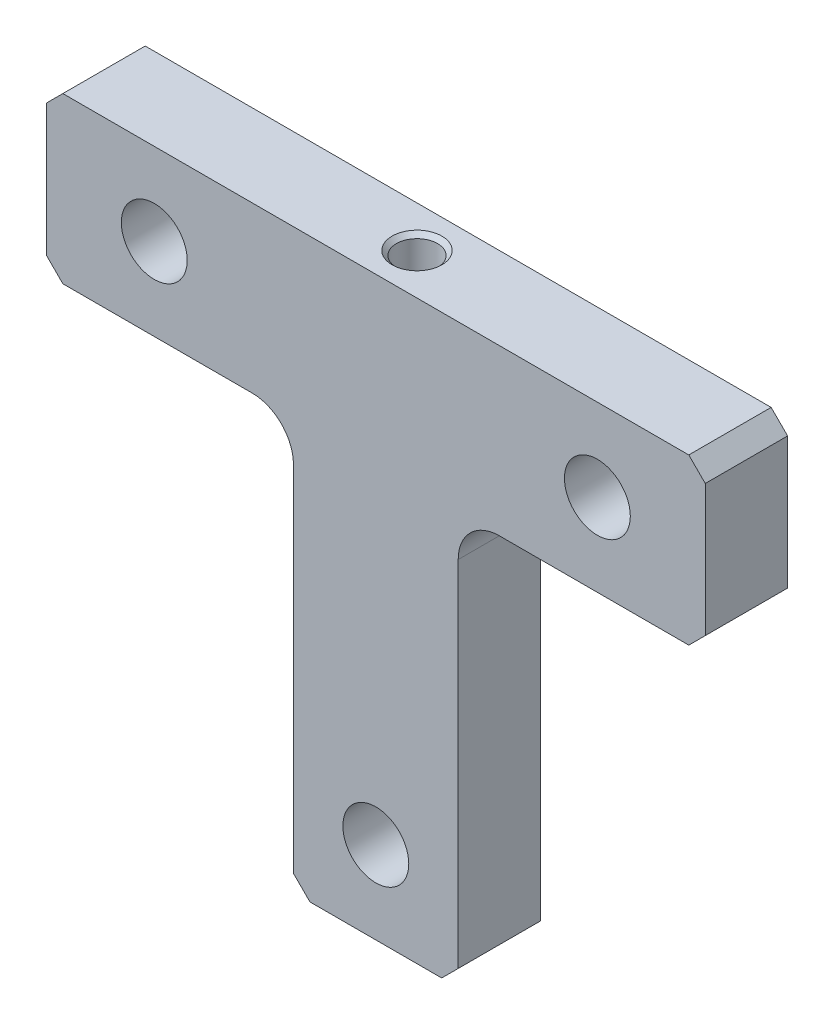
ISO-10303-21;
HEADER;
FILE_DESCRIPTION(('STEP AP214'),'2;1');
FILE_NAME('part.step','',(''),(''),'','','');
FILE_SCHEMA(('AUTOMOTIVE_DESIGN { 1 0 10303 214 1 1 1 1 }'));
ENDSEC;
DATA;
#1=APPLICATION_CONTEXT('core data for automotive mechanical design processes');
#2=APPLICATION_PROTOCOL_DEFINITION('international standard','automotive_design',2000,#1);
#3=PRODUCT_CONTEXT('',#1,'mechanical');
#4=PRODUCT('Part','Part','',(#3));
#5=PRODUCT_RELATED_PRODUCT_CATEGORY('part','',(#4));
#6=PRODUCT_DEFINITION_FORMATION('','',#4);
#7=PRODUCT_DEFINITION_CONTEXT('part definition',#1,'design');
#8=PRODUCT_DEFINITION('design','',#6,#7);
#9=PRODUCT_DEFINITION_SHAPE('','',#8);
#10=(LENGTH_UNIT() NAMED_UNIT(*) SI_UNIT(.MILLI.,.METRE.));
#11=(NAMED_UNIT(*) PLANE_ANGLE_UNIT() SI_UNIT($,.RADIAN.));
#12=(NAMED_UNIT(*) SI_UNIT($,.STERADIAN.) SOLID_ANGLE_UNIT());
#13=UNCERTAINTY_MEASURE_WITH_UNIT(LENGTH_MEASURE(1.E-05),#10,'distance_accuracy_value','');
#14=(GEOMETRIC_REPRESENTATION_CONTEXT(3) GLOBAL_UNCERTAINTY_ASSIGNED_CONTEXT((#13)) GLOBAL_UNIT_ASSIGNED_CONTEXT((#10,
#11,#12)) REPRESENTATION_CONTEXT('',''));
#15=CARTESIAN_POINT('',(0.,0.,0.));
#16=DIRECTION('',(0.,0.,1.));
#17=DIRECTION('',(1.,0.,0.));
#18=AXIS2_PLACEMENT_3D('',#15,#16,#17);
#19=CARTESIAN_POINT('',(10.0000000000001,-10.,4.99999999999994));
#20=DIRECTION('',(0.,1.00000000000001,0.));
#21=DIRECTION('',(-1.00000000000001,0.,0.));
#22=AXIS2_PLACEMENT_3D('',#19,#20,#21);
#23=PLANE('',#22);
#24=DIRECTION('',(1.00000000000001,0.,0.));
#25=VECTOR('',#24,1.);
#26=CARTESIAN_POINT('',(10.0000000000001,-10.,4.99999999999994));
#27=LINE('',#26,#25);
#28=CARTESIAN_POINT('',(-8.0000000000002,-9.99999999999998,4.99999999999994));
#29=VERTEX_POINT('',#28);
#30=CARTESIAN_POINT('',(8.0000000000001,-10.0000000000001,4.99999999999994));
#31=VERTEX_POINT('',#30);
#32=EDGE_CURVE('E204',#29,#31,#27,.T.);
#33=ORIENTED_EDGE('',*,*,#32,.F.);
#34=DIRECTION('',(0.,0.,-0.99999999999999));
#35=VECTOR('',#34,1.);
#36=CARTESIAN_POINT('',(-8.0000000000002,-9.99999999999998,4.99999999999994));
#37=LINE('',#36,#35);
#38=CARTESIAN_POINT('',(-8.0000000000002,-9.99999999999998,-4.99999999999994));
#39=VERTEX_POINT('',#38);
#40=EDGE_CURVE('E320',#29,#39,#37,.T.);
#41=ORIENTED_EDGE('',*,*,#40,.T.);
#42=DIRECTION('',(1.00000000000001,0.,0.));
#43=VECTOR('',#42,1.);
#44=CARTESIAN_POINT('',(10.0000000000001,-10.,-4.99999999999994));
#45=LINE('',#44,#43);
#46=CARTESIAN_POINT('',(8.0000000000001,-10.0000000000001,-4.99999999999994));
#47=VERTEX_POINT('',#46);
#48=EDGE_CURVE('E200',#39,#47,#45,.T.);
#49=ORIENTED_EDGE('',*,*,#48,.T.);
#50=DIRECTION('',(0.,0.,0.99999999999999));
#51=VECTOR('',#50,1.);
#52=CARTESIAN_POINT('',(8.0000000000001,-10.0000000000001,4.99999999999994));
#53=LINE('',#52,#51);
#54=EDGE_CURVE('E317',#47,#31,#53,.T.);
#55=ORIENTED_EDGE('',*,*,#54,.T.);
#56=EDGE_LOOP('',(#33,#41,#49,#55));
#57=FACE_BOUND('',#56,.T.);
#58=ADVANCED_FACE('F44',(#57),#23,.F.);
#59=CARTESIAN_POINT('',(10.0000000000001,40.0000000000005,4.99999999999994));
#60=DIRECTION('',(-1.00000000000001,0.,0.));
#61=DIRECTION('',(0.,-1.00000000000001,0.));
#62=AXIS2_PLACEMENT_3D('',#59,#60,#61);
#63=PLANE('',#62);
#64=DIRECTION('',(0.,1.00000000000001,0.));
#65=VECTOR('',#64,1.);
#66=CARTESIAN_POINT('',(10.0000000000001,40.0000000000005,-4.99999999999994));
#67=LINE('',#66,#65);
#68=CARTESIAN_POINT('',(10.,-8.00000000000006,-4.99999999999994));
#69=VERTEX_POINT('',#68);
#70=CARTESIAN_POINT('',(10.0000000000001,35.0000000000006,-4.99999999999994));
#71=VERTEX_POINT('',#70);
#72=EDGE_CURVE('E238',#69,#71,#67,.T.);
#73=ORIENTED_EDGE('',*,*,#72,.T.);
#74=DIRECTION('',(0.,0.,-0.99999999999999));
#75=VECTOR('',#74,1.);
#76=CARTESIAN_POINT('',(10.0000000000001,35.0000000000006,4.99999999999994));
#77=LINE('',#76,#75);
#78=CARTESIAN_POINT('',(10.0000000000001,35.0000000000006,4.99999999999994));
#79=VERTEX_POINT('',#78);
#80=EDGE_CURVE('E66',#71,#79,#77,.F.);
#81=ORIENTED_EDGE('',*,*,#80,.T.);
#82=DIRECTION('',(0.,1.00000000000001,0.));
#83=VECTOR('',#82,1.);
#84=CARTESIAN_POINT('',(10.0000000000001,40.0000000000005,4.99999999999994));
#85=LINE('',#84,#83);
#86=CARTESIAN_POINT('',(10.,-8.00000000000006,4.99999999999994));
#87=VERTEX_POINT('',#86);
#88=EDGE_CURVE('E208',#87,#79,#85,.T.);
#89=ORIENTED_EDGE('',*,*,#88,.F.);
#90=DIRECTION('',(0.,0.,-0.99999999999999));
#91=VECTOR('',#90,1.);
#92=CARTESIAN_POINT('',(10.,-8.00000000000006,4.99999999999994));
#93=LINE('',#92,#91);
#94=EDGE_CURVE('E328',#87,#69,#93,.T.);
#95=ORIENTED_EDGE('',*,*,#94,.T.);
#96=EDGE_LOOP('',(#73,#81,#89,#95));
#97=FACE_BOUND('',#96,.T.);
#98=ADVANCED_FACE('F474',(#97),#63,.F.);
#99=CARTESIAN_POINT('',(40.0000000000005,40.0000000000007,4.99999999999994));
#100=DIRECTION('',(0.,1.00000000000001,0.));
#101=DIRECTION('',(-1.00000000000001,0.,0.));
#102=AXIS2_PLACEMENT_3D('',#99,#100,#101);
#103=PLANE('',#102);
#104=DIRECTION('',(1.00000000000001,0.,0.));
#105=VECTOR('',#104,1.);
#106=CARTESIAN_POINT('',(40.0000000000005,40.0000000000007,4.99999999999994));
#107=LINE('',#106,#105);
#108=CARTESIAN_POINT('',(15.0000000000002,40.0000000000008,4.99999999999994));
#109=VERTEX_POINT('',#108);
#110=CARTESIAN_POINT('',(38.0000000000006,40.0000000000007,4.99999999999994));
#111=VERTEX_POINT('',#110);
#112=EDGE_CURVE('E212',#109,#111,#107,.T.);
#113=ORIENTED_EDGE('',*,*,#112,.F.);
#114=DIRECTION('',(0.,0.,-0.99999999999999));
#115=VECTOR('',#114,1.);
#116=CARTESIAN_POINT('',(15.0000000000002,40.0000000000008,-4.99999999999994));
#117=LINE('',#116,#115);
#118=CARTESIAN_POINT('',(15.0000000000002,40.0000000000008,-4.99999999999994));
#119=VERTEX_POINT('',#118);
#120=EDGE_CURVE('E350',#109,#119,#117,.T.);
#121=ORIENTED_EDGE('',*,*,#120,.T.);
#122=DIRECTION('',(1.00000000000001,0.,0.));
#123=VECTOR('',#122,1.);
#124=CARTESIAN_POINT('',(40.0000000000005,40.0000000000007,-4.99999999999994));
#125=LINE('',#124,#123);
#126=CARTESIAN_POINT('',(38.0000000000006,40.0000000000007,-4.99999999999994));
#127=VERTEX_POINT('',#126);
#128=EDGE_CURVE('E241',#119,#127,#125,.T.);
#129=ORIENTED_EDGE('',*,*,#128,.T.);
#130=DIRECTION('',(0.,0.,0.99999999999999));
#131=VECTOR('',#130,1.);
#132=CARTESIAN_POINT('',(38.0000000000006,40.0000000000007,4.99999999999994));
#133=LINE('',#132,#131);
#134=EDGE_CURVE('E339',#127,#111,#133,.T.);
#135=ORIENTED_EDGE('',*,*,#134,.T.);
#136=EDGE_LOOP('',(#113,#121,#129,#135));
#137=FACE_BOUND('',#136,.T.);
#138=ADVANCED_FACE('F468',(#137),#103,.F.);
#139=CARTESIAN_POINT('',(40.0000000000006,60.0000000000011,4.99999999999994));
#140=DIRECTION('',(-1.00000000000001,0.,0.));
#141=DIRECTION('',(0.,-1.00000000000001,0.));
#142=AXIS2_PLACEMENT_3D('',#139,#140,#141);
#143=PLANE('',#142);
#144=DIRECTION('',(0.,1.00000000000001,0.));
#145=VECTOR('',#144,1.);
#146=CARTESIAN_POINT('',(40.0000000000006,60.0000000000011,4.99999999999994));
#147=LINE('',#146,#145);
#148=CARTESIAN_POINT('',(40.0000000000006,42.0000000000005,4.99999999999994));
#149=VERTEX_POINT('',#148);
#150=CARTESIAN_POINT('',(40.0000000000006,58.0000000000009,4.99999999999994));
#151=VERTEX_POINT('',#150);
#152=EDGE_CURVE('E215',#149,#151,#147,.T.);
#153=ORIENTED_EDGE('',*,*,#152,.F.);
#154=DIRECTION('',(0.,0.,-0.99999999999999));
#155=VECTOR('',#154,1.);
#156=CARTESIAN_POINT('',(40.0000000000006,42.0000000000005,4.99999999999994));
#157=LINE('',#156,#155);
#158=CARTESIAN_POINT('',(40.0000000000006,42.0000000000005,-4.99999999999994));
#159=VERTEX_POINT('',#158);
#160=EDGE_CURVE('E335',#149,#159,#157,.T.);
#161=ORIENTED_EDGE('',*,*,#160,.T.);
#162=DIRECTION('',(0.,1.00000000000001,0.));
#163=VECTOR('',#162,1.);
#164=CARTESIAN_POINT('',(40.0000000000006,60.0000000000011,-4.99999999999994));
#165=LINE('',#164,#163);
#166=CARTESIAN_POINT('',(40.0000000000006,58.0000000000009,-4.99999999999994));
#167=VERTEX_POINT('',#166);
#168=EDGE_CURVE('E244',#159,#167,#165,.T.);
#169=ORIENTED_EDGE('',*,*,#168,.T.);
#170=DIRECTION('',(0.,0.,0.99999999999999));
#171=VECTOR('',#170,1.);
#172=CARTESIAN_POINT('',(40.0000000000006,58.0000000000009,4.99999999999994));
#173=LINE('',#172,#171);
#174=EDGE_CURVE('E332',#167,#151,#173,.T.);
#175=ORIENTED_EDGE('',*,*,#174,.T.);
#176=EDGE_LOOP('',(#153,#161,#169,#175));
#177=FACE_BOUND('',#176,.T.);
#178=ADVANCED_FACE('F460',(#177),#143,.F.);
#179=CARTESIAN_POINT('',(-40.0000000000005,60.0000000000009,4.99999999999994));
#180=DIRECTION('',(0.,-1.00000000000001,0.));
#181=DIRECTION('',(0.,0.,-0.99999999999999));
#182=AXIS2_PLACEMENT_3D('',#179,#180,#181);
#183=PLANE('',#182);
#184=CARTESIAN_POINT('',(0.,60.0000000000009,0.));
#185=DIRECTION('',(0.,1.00000000000001,0.));
#186=DIRECTION('',(0.,0.,0.99999999999999));
#187=AXIS2_PLACEMENT_3D('',#184,#185,#186);
#188=CIRCLE('',#187,3.025);
#189=CARTESIAN_POINT('',(0.,60.0000000000009,3.02499999999997));
#190=VERTEX_POINT('',#189);
#191=EDGE_CURVE('E180',#190,#190,#188,.T.);
#192=ORIENTED_EDGE('',*,*,#191,.F.);
#193=EDGE_LOOP('',(#192));
#194=FACE_BOUND('',#193,.T.);
#195=DIRECTION('',(-1.00000000000001,0.,0.));
#196=VECTOR('',#195,1.);
#197=CARTESIAN_POINT('',(-40.0000000000005,60.0000000000009,-4.99999999999994));
#198=LINE('',#197,#196);
#199=CARTESIAN_POINT('',(38.0000000000006,60.0000000000009,-4.99999999999994));
#200=VERTEX_POINT('',#199);
#201=CARTESIAN_POINT('',(-38.0000000000006,60.0000000000009,-4.99999999999994));
#202=VERTEX_POINT('',#201);
#203=EDGE_CURVE('E248',#200,#202,#198,.T.);
#204=ORIENTED_EDGE('',*,*,#203,.T.);
#205=DIRECTION('',(0.,0.,0.99999999999999));
#206=VECTOR('',#205,1.);
#207=CARTESIAN_POINT('',(-38.0000000000006,60.0000000000009,4.99999999999994));
#208=LINE('',#207,#206);
#209=CARTESIAN_POINT('',(-38.0000000000006,60.0000000000009,4.99999999999994));
#210=VERTEX_POINT('',#209);
#211=EDGE_CURVE('E292',#202,#210,#208,.T.);
#212=ORIENTED_EDGE('',*,*,#211,.T.);
#213=DIRECTION('',(-1.00000000000001,0.,0.));
#214=VECTOR('',#213,1.);
#215=CARTESIAN_POINT('',(-40.0000000000005,60.0000000000009,4.99999999999994));
#216=LINE('',#215,#214);
#217=CARTESIAN_POINT('',(38.0000000000006,60.0000000000009,4.99999999999994));
#218=VERTEX_POINT('',#217);
#219=EDGE_CURVE('E219',#218,#210,#216,.T.);
#220=ORIENTED_EDGE('',*,*,#219,.F.);
#221=DIRECTION('',(0.,0.,-0.99999999999999));
#222=VECTOR('',#221,1.);
#223=CARTESIAN_POINT('',(38.0000000000006,60.0000000000009,4.99999999999994));
#224=LINE('',#223,#222);
#225=EDGE_CURVE('E288',#218,#200,#224,.T.);
#226=ORIENTED_EDGE('',*,*,#225,.T.);
#227=EDGE_LOOP('',(#204,#212,#220,#226));
#228=FACE_BOUND('',#227,.T.);
#229=ADVANCED_FACE('F450',(#194,#228),#183,.F.);
#230=CARTESIAN_POINT('',(-40.0000000000006,40.0000000000005,4.99999999999994));
#231=DIRECTION('',(1.00000000000001,0.,0.));
#232=DIRECTION('',(0.,0.,-0.99999999999999));
#233=AXIS2_PLACEMENT_3D('',#230,#231,#232);
#234=PLANE('',#233);
#235=DIRECTION('',(0.,-1.00000000000001,0.));
#236=VECTOR('',#235,1.);
#237=CARTESIAN_POINT('',(-40.0000000000006,40.0000000000005,4.99999999999994));
#238=LINE('',#237,#236);
#239=CARTESIAN_POINT('',(-40.0000000000005,58.0000000000009,4.99999999999994));
#240=VERTEX_POINT('',#239);
#241=CARTESIAN_POINT('',(-40.0000000000006,42.0000000000005,4.99999999999994));
#242=VERTEX_POINT('',#241);
#243=EDGE_CURVE('E223',#240,#242,#238,.T.);
#244=ORIENTED_EDGE('',*,*,#243,.F.);
#245=DIRECTION('',(0.,0.,-0.99999999999999));
#246=VECTOR('',#245,1.);
#247=CARTESIAN_POINT('',(-40.0000000000005,58.0000000000009,4.99999999999994));
#248=LINE('',#247,#246);
#249=CARTESIAN_POINT('',(-40.0000000000005,58.0000000000009,-4.99999999999994));
#250=VERTEX_POINT('',#249);
#251=EDGE_CURVE('E264',#240,#250,#248,.T.);
#252=ORIENTED_EDGE('',*,*,#251,.T.);
#253=DIRECTION('',(0.,-1.00000000000001,0.));
#254=VECTOR('',#253,1.);
#255=CARTESIAN_POINT('',(-40.0000000000006,40.0000000000005,-4.99999999999994));
#256=LINE('',#255,#254);
#257=CARTESIAN_POINT('',(-40.0000000000006,42.0000000000005,-4.99999999999994));
#258=VERTEX_POINT('',#257);
#259=EDGE_CURVE('E252',#250,#258,#256,.T.);
#260=ORIENTED_EDGE('',*,*,#259,.T.);
#261=DIRECTION('',(0.,0.,0.99999999999999));
#262=VECTOR('',#261,1.);
#263=CARTESIAN_POINT('',(-40.0000000000006,42.0000000000005,4.99999999999994));
#264=LINE('',#263,#262);
#265=EDGE_CURVE('E234',#258,#242,#264,.T.);
#266=ORIENTED_EDGE('',*,*,#265,.T.);
#267=EDGE_LOOP('',(#244,#252,#260,#266));
#268=FACE_BOUND('',#267,.T.);
#269=ADVANCED_FACE('F442',(#268),#234,.F.);
#270=CARTESIAN_POINT('',(-10.0000000000002,40.0000000000007,4.99999999999994));
#271=DIRECTION('',(0.,1.00000000000001,0.));
#272=DIRECTION('',(-1.00000000000001,0.,0.));
#273=AXIS2_PLACEMENT_3D('',#270,#271,#272);
#274=PLANE('',#273);
#275=DIRECTION('',(1.00000000000001,0.,0.));
#276=VECTOR('',#275,1.);
#277=CARTESIAN_POINT('',(-10.0000000000002,40.0000000000007,-4.99999999999994));
#278=LINE('',#277,#276);
#279=CARTESIAN_POINT('',(-38.0000000000006,40.0000000000007,-4.99999999999994));
#280=VERTEX_POINT('',#279);
#281=CARTESIAN_POINT('',(-15.0000000000002,40.0000000000005,-4.99999999999994));
#282=VERTEX_POINT('',#281);
#283=EDGE_CURVE('E256',#280,#282,#278,.T.);
#284=ORIENTED_EDGE('',*,*,#283,.T.);
#285=DIRECTION('',(0.,0.,-0.99999999999999));
#286=VECTOR('',#285,1.);
#287=CARTESIAN_POINT('',(-15.0000000000002,40.0000000000005,4.99999999999994));
#288=LINE('',#287,#286);
#289=CARTESIAN_POINT('',(-15.0000000000002,40.0000000000005,4.99999999999994));
#290=VERTEX_POINT('',#289);
#291=EDGE_CURVE('E347',#282,#290,#288,.F.);
#292=ORIENTED_EDGE('',*,*,#291,.T.);
#293=DIRECTION('',(1.00000000000001,0.,0.));
#294=VECTOR('',#293,1.);
#295=CARTESIAN_POINT('',(-10.0000000000002,40.0000000000007,4.99999999999994));
#296=LINE('',#295,#294);
#297=CARTESIAN_POINT('',(-38.0000000000006,40.0000000000007,4.99999999999994));
#298=VERTEX_POINT('',#297);
#299=EDGE_CURVE('E227',#298,#290,#296,.T.);
#300=ORIENTED_EDGE('',*,*,#299,.F.);
#301=DIRECTION('',(0.,0.,-0.99999999999999));
#302=VECTOR('',#301,1.);
#303=CARTESIAN_POINT('',(-38.0000000000006,40.0000000000007,4.99999999999994));
#304=LINE('',#303,#302);
#305=EDGE_CURVE('E313',#298,#280,#304,.T.);
#306=ORIENTED_EDGE('',*,*,#305,.T.);
#307=EDGE_LOOP('',(#284,#292,#300,#306));
#308=FACE_BOUND('',#307,.T.);
#309=ADVANCED_FACE('F434',(#308),#274,.F.);
#310=CARTESIAN_POINT('',(-10.0000000000002,-10.0000000000001,4.99999999999994));
#311=DIRECTION('',(1.00000000000001,0.,0.));
#312=DIRECTION('',(0.,0.,-0.99999999999999));
#313=AXIS2_PLACEMENT_3D('',#310,#311,#312);
#314=PLANE('',#313);
#315=DIRECTION('',(0.,-1.00000000000001,0.));
#316=VECTOR('',#315,1.);
#317=CARTESIAN_POINT('',(-10.0000000000002,-10.0000000000001,4.99999999999994));
#318=LINE('',#317,#316);
#319=CARTESIAN_POINT('',(-10.0000000000001,35.0000000000007,4.99999999999994));
#320=VERTEX_POINT('',#319);
#321=CARTESIAN_POINT('',(-10.0000000000002,-8.00000000000015,4.99999999999994));
#322=VERTEX_POINT('',#321);
#323=EDGE_CURVE('E231',#320,#322,#318,.T.);
#324=ORIENTED_EDGE('',*,*,#323,.F.);
#325=DIRECTION('',(0.,0.,-0.99999999999999));
#326=VECTOR('',#325,1.);
#327=CARTESIAN_POINT('',(-10.0000000000001,35.0000000000007,-4.99999999999994));
#328=LINE('',#327,#326);
#329=CARTESIAN_POINT('',(-10.0000000000001,35.0000000000007,-4.99999999999994));
#330=VERTEX_POINT('',#329);
#331=EDGE_CURVE('E343',#320,#330,#328,.T.);
#332=ORIENTED_EDGE('',*,*,#331,.T.);
#333=DIRECTION('',(0.,-1.00000000000001,0.));
#334=VECTOR('',#333,1.);
#335=CARTESIAN_POINT('',(-10.0000000000002,-10.0000000000001,-4.99999999999994));
#336=LINE('',#335,#334);
#337=CARTESIAN_POINT('',(-10.0000000000002,-8.00000000000015,-4.99999999999994));
#338=VERTEX_POINT('',#337);
#339=EDGE_CURVE('E209',#330,#338,#336,.T.);
#340=ORIENTED_EDGE('',*,*,#339,.T.);
#341=DIRECTION('',(0.,0.,0.99999999999999));
#342=VECTOR('',#341,1.);
#343=CARTESIAN_POINT('',(-10.0000000000002,-8.00000000000015,4.99999999999994));
#344=LINE('',#343,#342);
#345=EDGE_CURVE('E324',#338,#322,#344,.T.);
#346=ORIENTED_EDGE('',*,*,#345,.T.);
#347=EDGE_LOOP('',(#324,#332,#340,#346));
#348=FACE_BOUND('',#347,.T.);
#349=ADVANCED_FACE('F425',(#348),#314,.F.);
#350=CARTESIAN_POINT('',(0.,0.,4.99999999999994));
#351=DIRECTION('',(0.,0.,-0.99999999999999));
#352=DIRECTION('',(-1.00000000000001,0.,0.));
#353=AXIS2_PLACEMENT_3D('',#350,#351,#352);
#354=PLANE('',#353);
#355=CARTESIAN_POINT('',(-26.9000000000004,50.000000000001,4.99999999999994));
#356=DIRECTION('',(0.,0.,-0.99999999999999));
#357=DIRECTION('',(-1.00000000000001,0.,0.));
#358=AXIS2_PLACEMENT_3D('',#355,#356,#357);
#359=CIRCLE('',#358,4.);
#360=CARTESIAN_POINT('',(-30.9000000000005,50.000000000001,4.99999999999994));
#361=VERTEX_POINT('',#360);
#362=EDGE_CURVE('E170',#361,#361,#359,.T.);
#363=ORIENTED_EDGE('',*,*,#362,.T.);
#364=EDGE_LOOP('',(#363));
#365=FACE_BOUND('',#364,.T.);
#366=CARTESIAN_POINT('',(26.9000000000004,50.0000000000009,4.99999999999994));
#367=DIRECTION('',(0.,0.,0.99999999999999));
#368=DIRECTION('',(1.00000000000001,0.,0.));
#369=AXIS2_PLACEMENT_3D('',#366,#367,#368);
#370=CIRCLE('',#369,4.);
#371=CARTESIAN_POINT('',(30.9000000000004,50.0000000000009,4.99999999999994));
#372=VERTEX_POINT('',#371);
#373=EDGE_CURVE('E186',#372,#372,#370,.T.);
#374=ORIENTED_EDGE('',*,*,#373,.F.);
#375=EDGE_LOOP('',(#374));
#376=FACE_BOUND('',#375,.T.);
#377=CARTESIAN_POINT('',(0.,0.,4.99999999999994));
#378=DIRECTION('',(0.,0.,0.99999999999999));
#379=DIRECTION('',(1.00000000000001,0.,0.));
#380=AXIS2_PLACEMENT_3D('',#377,#378,#379);
#381=CIRCLE('',#380,4.);
#382=CARTESIAN_POINT('',(4.00000000000006,0.,4.99999999999994));
#383=VERTEX_POINT('',#382);
#384=EDGE_CURVE('E192',#383,#383,#381,.T.);
#385=ORIENTED_EDGE('',*,*,#384,.F.);
#386=EDGE_LOOP('',(#385));
#387=FACE_BOUND('',#386,.T.);
#388=ORIENTED_EDGE('',*,*,#219,.T.);
#389=DIRECTION('',(0.707106781186558,0.707106781186557,0.));
#390=VECTOR('',#389,1.);
#391=CARTESIAN_POINT('',(-40.0000000000005,58.0000000000009,4.99999999999994));
#392=LINE('',#391,#390);
#393=EDGE_CURVE('E310',#210,#240,#392,.F.);
#394=ORIENTED_EDGE('',*,*,#393,.T.);
#395=ORIENTED_EDGE('',*,*,#243,.T.);
#396=DIRECTION('',(-0.707106781186557,0.707106781186558,0.));
#397=VECTOR('',#396,1.);
#398=CARTESIAN_POINT('',(-38.0000000000006,40.0000000000007,4.99999999999994));
#399=LINE('',#398,#397);
#400=EDGE_CURVE('E307',#242,#298,#399,.F.);
#401=ORIENTED_EDGE('',*,*,#400,.T.);
#402=ORIENTED_EDGE('',*,*,#299,.T.);
#403=CARTESIAN_POINT('',(-15.0000000000003,35.0000000000006,4.99999999999994));
#404=DIRECTION('',(0.,0.,-0.99999999999999));
#405=DIRECTION('',(-1.00000000000001,0.,0.));
#406=AXIS2_PLACEMENT_3D('',#403,#404,#405);
#407=CIRCLE('',#406,5.);
#408=EDGE_CURVE('E359',#290,#320,#407,.T.);
#409=ORIENTED_EDGE('',*,*,#408,.T.);
#410=ORIENTED_EDGE('',*,*,#323,.T.);
#411=DIRECTION('',(-0.707106781186557,0.707106781186558,0.));
#412=VECTOR('',#411,1.);
#413=CARTESIAN_POINT('',(-8.0000000000002,-9.99999999999998,4.99999999999994));
#414=LINE('',#413,#412);
#415=EDGE_CURVE('E304',#322,#29,#414,.F.);
#416=ORIENTED_EDGE('',*,*,#415,.T.);
#417=ORIENTED_EDGE('',*,*,#32,.T.);
#418=DIRECTION('',(-0.707106781186558,-0.707106781186556,0.));
#419=VECTOR('',#418,1.);
#420=CARTESIAN_POINT('',(10.,-8.00000000000006,4.99999999999994));
#421=LINE('',#420,#419);
#422=EDGE_CURVE('E301',#31,#87,#421,.F.);
#423=ORIENTED_EDGE('',*,*,#422,.T.);
#424=ORIENTED_EDGE('',*,*,#88,.T.);
#425=CARTESIAN_POINT('',(15.0000000000002,35.0000000000007,4.99999999999994));
#426=DIRECTION('',(0.,0.,-0.99999999999999));
#427=DIRECTION('',(-1.00000000000001,0.,0.));
#428=AXIS2_PLACEMENT_3D('',#425,#426,#427);
#429=CIRCLE('',#428,5.);
#430=EDGE_CURVE('E11',#79,#109,#429,.T.);
#431=ORIENTED_EDGE('',*,*,#430,.T.);
#432=ORIENTED_EDGE('',*,*,#112,.T.);
#433=DIRECTION('',(-0.707106781186558,-0.707106781186557,0.));
#434=VECTOR('',#433,1.);
#435=CARTESIAN_POINT('',(40.0000000000006,42.0000000000005,4.99999999999994));
#436=LINE('',#435,#434);
#437=EDGE_CURVE('E298',#111,#149,#436,.F.);
#438=ORIENTED_EDGE('',*,*,#437,.T.);
#439=ORIENTED_EDGE('',*,*,#152,.T.);
#440=DIRECTION('',(0.707106781186557,-0.707106781186558,0.));
#441=VECTOR('',#440,1.);
#442=CARTESIAN_POINT('',(38.0000000000006,60.0000000000009,4.99999999999994));
#443=LINE('',#442,#441);
#444=EDGE_CURVE('E295',#151,#218,#443,.F.);
#445=ORIENTED_EDGE('',*,*,#444,.T.);
#446=EDGE_LOOP('',(#388,#394,#395,#401,#402,#409,#410,#416,#417,#423,#424,#431,#432,#438,#439,#445));
#447=FACE_BOUND('',#446,.T.);
#448=ADVANCED_FACE('F419',(#365,#376,#387,#447),#354,.F.);
#449=CARTESIAN_POINT('',(0.,0.,-4.99999999999994));
#450=DIRECTION('',(0.,0.,-0.99999999999999));
#451=DIRECTION('',(-1.00000000000001,0.,0.));
#452=AXIS2_PLACEMENT_3D('',#449,#450,#451);
#453=PLANE('',#452);
#454=CARTESIAN_POINT('',(-26.9000000000004,50.000000000001,-4.99999999999994));
#455=DIRECTION('',(0.,0.,-0.99999999999999));
#456=DIRECTION('',(-1.00000000000001,0.,0.));
#457=AXIS2_PLACEMENT_3D('',#454,#455,#456);
#458=CIRCLE('',#457,4.);
#459=CARTESIAN_POINT('',(-30.9000000000005,50.000000000001,-4.99999999999994));
#460=VERTEX_POINT('',#459);
#461=EDGE_CURVE('E177',#460,#460,#458,.T.);
#462=ORIENTED_EDGE('',*,*,#461,.F.);
#463=EDGE_LOOP('',(#462));
#464=FACE_BOUND('',#463,.T.);
#465=CARTESIAN_POINT('',(26.9000000000004,50.0000000000009,-4.99999999999994));
#466=DIRECTION('',(0.,0.,0.99999999999999));
#467=DIRECTION('',(1.00000000000001,0.,0.));
#468=AXIS2_PLACEMENT_3D('',#465,#466,#467);
#469=CIRCLE('',#468,4.);
#470=CARTESIAN_POINT('',(30.9000000000004,50.0000000000009,-4.99999999999994));
#471=VERTEX_POINT('',#470);
#472=EDGE_CURVE('E188',#471,#471,#469,.T.);
#473=ORIENTED_EDGE('',*,*,#472,.T.);
#474=EDGE_LOOP('',(#473));
#475=FACE_BOUND('',#474,.T.);
#476=CARTESIAN_POINT('',(0.,0.,-4.99999999999994));
#477=DIRECTION('',(0.,0.,0.99999999999999));
#478=DIRECTION('',(1.00000000000001,0.,0.));
#479=AXIS2_PLACEMENT_3D('',#476,#477,#478);
#480=CIRCLE('',#479,4.);
#481=CARTESIAN_POINT('',(4.00000000000006,0.,-4.99999999999994));
#482=VERTEX_POINT('',#481);
#483=EDGE_CURVE('E196',#482,#482,#480,.T.);
#484=ORIENTED_EDGE('',*,*,#483,.T.);
#485=EDGE_LOOP('',(#484));
#486=FACE_BOUND('',#485,.T.);
#487=ORIENTED_EDGE('',*,*,#259,.F.);
#488=DIRECTION('',(-0.707106781186558,-0.707106781186557,0.));
#489=VECTOR('',#488,1.);
#490=CARTESIAN_POINT('',(-49.0000000000007,49.0000000000008,-4.99999999999994));
#491=LINE('',#490,#489);
#492=EDGE_CURVE('E285',#250,#202,#491,.F.);
#493=ORIENTED_EDGE('',*,*,#492,.T.);
#494=ORIENTED_EDGE('',*,*,#203,.F.);
#495=DIRECTION('',(-0.707106781186557,0.707106781186558,0.));
#496=VECTOR('',#495,1.);
#497=CARTESIAN_POINT('',(49.0000000000007,49.0000000000007,-4.99999999999994));
#498=LINE('',#497,#496);
#499=EDGE_CURVE('E268',#200,#167,#498,.F.);
#500=ORIENTED_EDGE('',*,*,#499,.T.);
#501=ORIENTED_EDGE('',*,*,#168,.F.);
#502=DIRECTION('',(0.707106781186558,0.707106781186557,0.));
#503=VECTOR('',#502,1.);
#504=CARTESIAN_POINT('',(-1.00000000000006,1.00000000000008,-4.99999999999994));
#505=LINE('',#504,#503);
#506=EDGE_CURVE('E271',#159,#127,#505,.F.);
#507=ORIENTED_EDGE('',*,*,#506,.T.);
#508=ORIENTED_EDGE('',*,*,#128,.F.);
#509=CARTESIAN_POINT('',(15.0000000000002,35.0000000000007,-4.99999999999994));
#510=DIRECTION('',(0.,0.,-0.99999999999999));
#511=DIRECTION('',(-1.00000000000001,0.,0.));
#512=AXIS2_PLACEMENT_3D('',#509,#510,#511);
#513=CIRCLE('',#512,5.);
#514=EDGE_CURVE('E53',#119,#71,#513,.F.);
#515=ORIENTED_EDGE('',*,*,#514,.T.);
#516=ORIENTED_EDGE('',*,*,#72,.F.);
#517=DIRECTION('',(0.707106781186558,0.707106781186556,0.));
#518=VECTOR('',#517,1.);
#519=CARTESIAN_POINT('',(9.00000000000001,-8.99999999999998,-4.99999999999994));
#520=LINE('',#519,#518);
#521=EDGE_CURVE('E275',#69,#47,#520,.F.);
#522=ORIENTED_EDGE('',*,*,#521,.T.);
#523=ORIENTED_EDGE('',*,*,#48,.F.);
#524=DIRECTION('',(0.707106781186557,-0.707106781186558,0.));
#525=VECTOR('',#524,1.);
#526=CARTESIAN_POINT('',(-9.00000000000019,-9.00000000000003,-4.99999999999994));
#527=LINE('',#526,#525);
#528=EDGE_CURVE('E278',#39,#338,#527,.F.);
#529=ORIENTED_EDGE('',*,*,#528,.T.);
#530=ORIENTED_EDGE('',*,*,#339,.F.);
#531=CARTESIAN_POINT('',(-15.0000000000003,35.0000000000006,-4.99999999999994));
#532=DIRECTION('',(0.,0.,-0.99999999999999));
#533=DIRECTION('',(-1.00000000000001,0.,0.));
#534=AXIS2_PLACEMENT_3D('',#531,#532,#533);
#535=CIRCLE('',#534,5.);
#536=EDGE_CURVE('E356',#330,#282,#535,.F.);
#537=ORIENTED_EDGE('',*,*,#536,.T.);
#538=ORIENTED_EDGE('',*,*,#283,.F.);
#539=DIRECTION('',(0.707106781186557,-0.707106781186558,0.));
#540=VECTOR('',#539,1.);
#541=CARTESIAN_POINT('',(1.00000000000001,1.00000000000015,-4.99999999999994));
#542=LINE('',#541,#540);
#543=EDGE_CURVE('E282',#280,#258,#542,.F.);
#544=ORIENTED_EDGE('',*,*,#543,.T.);
#545=EDGE_LOOP('',(#487,#493,#494,#500,#501,#507,#508,#515,#516,#522,#523,#529,#530,#537,#538,#544));
#546=FACE_BOUND('',#545,.T.);
#547=ADVANCED_FACE('F432',(#464,#475,#486,#546),#453,.T.);
#548=CARTESIAN_POINT('',(0.,0.,-4.99999999999994));
#549=DIRECTION('',(0.,0.,0.99999999999999));
#550=DIRECTION('',(1.00000000000001,0.,0.));
#551=AXIS2_PLACEMENT_3D('',#548,#549,#550);
#552=CYLINDRICAL_SURFACE('',#551,4.);
#553=ORIENTED_EDGE('',*,*,#483,.F.);
#554=EDGE_LOOP('',(#553));
#555=FACE_BOUND('',#554,.T.);
#556=ORIENTED_EDGE('',*,*,#384,.T.);
#557=EDGE_LOOP('',(#556));
#558=FACE_BOUND('',#557,.T.);
#559=ADVANCED_FACE('F613',(#555,#558),#552,.F.);
#560=CARTESIAN_POINT('',(26.9000000000004,50.0000000000009,-4.99999999999994));
#561=DIRECTION('',(0.,0.,0.99999999999999));
#562=DIRECTION('',(1.00000000000001,0.,0.));
#563=AXIS2_PLACEMENT_3D('',#560,#561,#562);
#564=CYLINDRICAL_SURFACE('',#563,4.);
#565=ORIENTED_EDGE('',*,*,#472,.F.);
#566=EDGE_LOOP('',(#565));
#567=FACE_BOUND('',#566,.T.);
#568=ORIENTED_EDGE('',*,*,#373,.T.);
#569=EDGE_LOOP('',(#568));
#570=FACE_BOUND('',#569,.T.);
#571=ADVANCED_FACE('F603',(#567,#570),#564,.F.);
#572=CARTESIAN_POINT('',(-26.9000000000004,50.000000000001,-4.99999999999994));
#573=DIRECTION('',(0.,0.,0.99999999999999));
#574=DIRECTION('',(1.00000000000001,0.,0.));
#575=AXIS2_PLACEMENT_3D('',#572,#573,#574);
#576=CYLINDRICAL_SURFACE('',#575,4.);
#577=ORIENTED_EDGE('',*,*,#461,.T.);
#578=EDGE_LOOP('',(#577));
#579=FACE_BOUND('',#578,.T.);
#580=ORIENTED_EDGE('',*,*,#362,.F.);
#581=EDGE_LOOP('',(#580));
#582=FACE_BOUND('',#581,.T.);
#583=ADVANCED_FACE('F163',(#579,#582),#576,.F.);
#584=CARTESIAN_POINT('',(0.,45.0000000000007,0.));
#585=DIRECTION('',(0.,1.00000000000001,0.));
#586=DIRECTION('',(0.,0.,0.99999999999999));
#587=AXIS2_PLACEMENT_3D('',#584,#585,#586);
#588=CONICAL_SURFACE('',#587,2.5,1.02974425867665);
#589=CARTESIAN_POINT('',(0.,43.4978484524318,0.));
#590=VERTEX_POINT('',#589);
#591=VERTEX_LOOP('',#590);
#592=FACE_BOUND('',#591,.T.);
#593=CARTESIAN_POINT('',(0.,45.0000000000007,0.));
#594=DIRECTION('',(0.,1.00000000000001,0.));
#595=DIRECTION('',(0.,0.,0.99999999999999));
#596=AXIS2_PLACEMENT_3D('',#593,#594,#595);
#597=CIRCLE('',#596,2.5);
#598=CARTESIAN_POINT('',(0.,45.0000000000007,2.49999999999997));
#599=VERTEX_POINT('',#598);
#600=EDGE_CURVE('E167',#599,#599,#597,.T.);
#601=ORIENTED_EDGE('',*,*,#600,.T.);
#602=EDGE_LOOP('',(#601));
#603=FACE_BOUND('',#602,.T.);
#604=ADVANCED_FACE('F159',(#592,#603),#588,.F.);
#605=CARTESIAN_POINT('',(0.,60.0000000000009,0.));
#606=DIRECTION('',(0.,1.00000000000001,0.));
#607=DIRECTION('',(0.,0.,0.99999999999999));
#608=AXIS2_PLACEMENT_3D('',#605,#606,#607);
#609=CYLINDRICAL_SURFACE('',#608,2.5);
#610=ORIENTED_EDGE('',*,*,#600,.F.);
#611=EDGE_LOOP('',(#610));
#612=FACE_BOUND('',#611,.T.);
#613=CARTESIAN_POINT('',(0.,59.4750000000009,0.));
#614=DIRECTION('',(0.,1.00000000000001,0.));
#615=DIRECTION('',(0.,0.,0.99999999999999));
#616=AXIS2_PLACEMENT_3D('',#613,#614,#615);
#617=CIRCLE('',#616,2.5);
#618=CARTESIAN_POINT('',(0.,59.4750000000009,2.49999999999997));
#619=VERTEX_POINT('',#618);
#620=EDGE_CURVE('E171',#619,#619,#617,.T.);
#621=ORIENTED_EDGE('',*,*,#620,.T.);
#622=EDGE_LOOP('',(#621));
#623=FACE_BOUND('',#622,.T.);
#624=ADVANCED_FACE('F162',(#612,#623),#609,.F.);
#625=CARTESIAN_POINT('',(0.,60.0000000000009,0.));
#626=DIRECTION('',(0.,1.00000000000001,0.));
#627=DIRECTION('',(0.,0.,0.99999999999999));
#628=AXIS2_PLACEMENT_3D('',#625,#626,#627);
#629=CONICAL_SURFACE('',#628,3.025,0.785398163397445);
#630=ORIENTED_EDGE('',*,*,#620,.F.);
#631=EDGE_LOOP('',(#630));
#632=FACE_BOUND('',#631,.T.);
#633=ORIENTED_EDGE('',*,*,#191,.T.);
#634=EDGE_LOOP('',(#633));
#635=FACE_BOUND('',#634,.T.);
#636=ADVANCED_FACE('F506',(#632,#635),#629,.F.);
#637=CARTESIAN_POINT('',(-40.0000000000005,58.0000000000009,4.99999999999994));
#638=DIRECTION('',(0.707106781186557,-0.707106781186557,0.));
#639=DIRECTION('',(0.,0.,-0.99999999999999));
#640=AXIS2_PLACEMENT_3D('',#637,#638,#639);
#641=PLANE('',#640);
#642=ORIENTED_EDGE('',*,*,#393,.F.);
#643=ORIENTED_EDGE('',*,*,#211,.F.);
#644=ORIENTED_EDGE('',*,*,#492,.F.);
#645=ORIENTED_EDGE('',*,*,#251,.F.);
#646=EDGE_LOOP('',(#642,#643,#644,#645));
#647=FACE_BOUND('',#646,.T.);
#648=ADVANCED_FACE('F446',(#647),#641,.F.);
#649=CARTESIAN_POINT('',(-38.0000000000006,40.0000000000007,4.99999999999994));
#650=DIRECTION('',(0.707106781186557,0.707106781186557,0.));
#651=DIRECTION('',(0.,0.,-0.99999999999999));
#652=AXIS2_PLACEMENT_3D('',#649,#650,#651);
#653=PLANE('',#652);
#654=ORIENTED_EDGE('',*,*,#400,.F.);
#655=ORIENTED_EDGE('',*,*,#265,.F.);
#656=ORIENTED_EDGE('',*,*,#543,.F.);
#657=ORIENTED_EDGE('',*,*,#305,.F.);
#658=EDGE_LOOP('',(#654,#655,#656,#657));
#659=FACE_BOUND('',#658,.T.);
#660=ADVANCED_FACE('F438',(#659),#653,.F.);
#661=CARTESIAN_POINT('',(-8.0000000000002,-9.99999999999998,4.99999999999994));
#662=DIRECTION('',(0.707106781186558,0.707106781186557,0.));
#663=DIRECTION('',(0.,0.,-0.99999999999999));
#664=AXIS2_PLACEMENT_3D('',#661,#662,#663);
#665=PLANE('',#664);
#666=ORIENTED_EDGE('',*,*,#415,.F.);
#667=ORIENTED_EDGE('',*,*,#345,.F.);
#668=ORIENTED_EDGE('',*,*,#528,.F.);
#669=ORIENTED_EDGE('',*,*,#40,.F.);
#670=EDGE_LOOP('',(#666,#667,#668,#669));
#671=FACE_BOUND('',#670,.T.);
#672=ADVANCED_FACE('F483',(#671),#665,.F.);
#673=CARTESIAN_POINT('',(10.,-8.00000000000006,4.99999999999994));
#674=DIRECTION('',(-0.707106781186556,0.707106781186558,0.));
#675=DIRECTION('',(0.,0.,-0.99999999999999));
#676=AXIS2_PLACEMENT_3D('',#673,#674,#675);
#677=PLANE('',#676);
#678=ORIENTED_EDGE('',*,*,#422,.F.);
#679=ORIENTED_EDGE('',*,*,#54,.F.);
#680=ORIENTED_EDGE('',*,*,#521,.F.);
#681=ORIENTED_EDGE('',*,*,#94,.F.);
#682=EDGE_LOOP('',(#678,#679,#680,#681));
#683=FACE_BOUND('',#682,.T.);
#684=ADVANCED_FACE('F476',(#683),#677,.F.);
#685=CARTESIAN_POINT('',(40.0000000000006,42.0000000000005,4.99999999999994));
#686=DIRECTION('',(-0.707106781186557,0.707106781186557,0.));
#687=DIRECTION('',(0.,0.,-0.99999999999999));
#688=AXIS2_PLACEMENT_3D('',#685,#686,#687);
#689=PLANE('',#688);
#690=ORIENTED_EDGE('',*,*,#437,.F.);
#691=ORIENTED_EDGE('',*,*,#134,.F.);
#692=ORIENTED_EDGE('',*,*,#506,.F.);
#693=ORIENTED_EDGE('',*,*,#160,.F.);
#694=EDGE_LOOP('',(#690,#691,#692,#693));
#695=FACE_BOUND('',#694,.T.);
#696=ADVANCED_FACE('F464',(#695),#689,.F.);
#697=CARTESIAN_POINT('',(38.0000000000006,60.0000000000009,4.99999999999994));
#698=DIRECTION('',(-0.707106781186557,-0.707106781186557,0.));
#699=DIRECTION('',(0.,0.,-0.99999999999999));
#700=AXIS2_PLACEMENT_3D('',#697,#698,#699);
#701=PLANE('',#700);
#702=ORIENTED_EDGE('',*,*,#444,.F.);
#703=ORIENTED_EDGE('',*,*,#174,.F.);
#704=ORIENTED_EDGE('',*,*,#499,.F.);
#705=ORIENTED_EDGE('',*,*,#225,.F.);
#706=EDGE_LOOP('',(#702,#703,#704,#705));
#707=FACE_BOUND('',#706,.T.);
#708=ADVANCED_FACE('F455',(#707),#701,.F.);
#709=CARTESIAN_POINT('',(-15.0000000000003,35.0000000000006,4.99999999999994));
#710=DIRECTION('',(0.,0.,0.99999999999999));
#711=DIRECTION('',(1.00000000000001,0.,0.));
#712=AXIS2_PLACEMENT_3D('',#709,#710,#711);
#713=CYLINDRICAL_SURFACE('',#712,5.);
#714=ORIENTED_EDGE('',*,*,#408,.F.);
#715=ORIENTED_EDGE('',*,*,#291,.F.);
#716=ORIENTED_EDGE('',*,*,#536,.F.);
#717=ORIENTED_EDGE('',*,*,#331,.F.);
#718=EDGE_LOOP('',(#714,#715,#716,#717));
#719=FACE_BOUND('',#718,.T.);
#720=ADVANCED_FACE('F429',(#719),#713,.F.);
#721=CARTESIAN_POINT('',(15.0000000000002,35.0000000000007,4.99999999999994));
#722=DIRECTION('',(0.,0.,0.99999999999999));
#723=DIRECTION('',(1.00000000000001,0.,0.));
#724=AXIS2_PLACEMENT_3D('',#721,#722,#723);
#725=CYLINDRICAL_SURFACE('',#724,5.);
#726=ORIENTED_EDGE('',*,*,#430,.F.);
#727=ORIENTED_EDGE('',*,*,#80,.F.);
#728=ORIENTED_EDGE('',*,*,#514,.F.);
#729=ORIENTED_EDGE('',*,*,#120,.F.);
#730=EDGE_LOOP('',(#726,#727,#728,#729));
#731=FACE_BOUND('',#730,.T.);
#732=ADVANCED_FACE('F46',(#731),#725,.F.);
#733=CLOSED_SHELL('',(#58,#98,#138,#178,#229,#269,#309,#349,#448,#547,#559,#571,#583,#604,#624,
#636,#648,#660,#672,#684,#696,#708,#720,#732));
#734=MANIFOLD_SOLID_BREP('B2',#733);
#735=ADVANCED_BREP_SHAPE_REPRESENTATION('',(#18,#734),#14);
#736=SHAPE_DEFINITION_REPRESENTATION(#9,#735);
ENDSEC;
END-ISO-10303-21;
